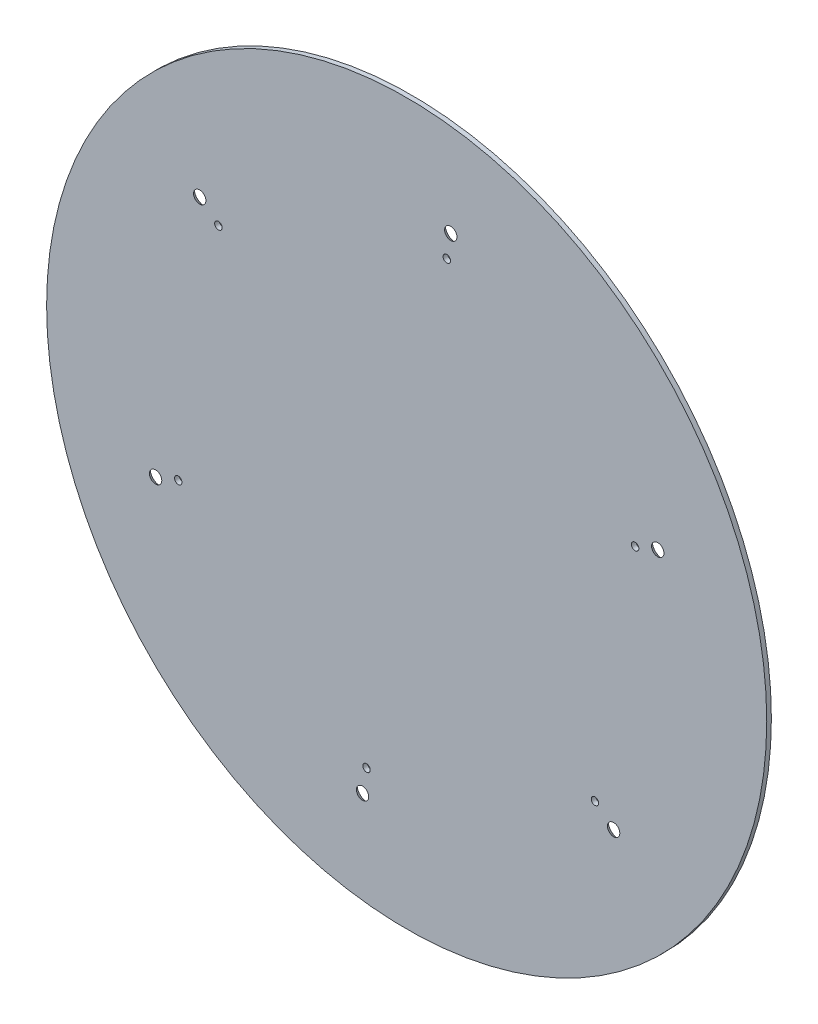
ISO-10303-21;
HEADER;
FILE_DESCRIPTION(('STEP AP214'),'2;1');
FILE_NAME('part.step','',(''),(''),'','','');
FILE_SCHEMA(('AUTOMOTIVE_DESIGN { 1 0 10303 214 1 1 1 1 }'));
ENDSEC;
DATA;
#1=APPLICATION_CONTEXT('core data for automotive mechanical design processes');
#2=APPLICATION_PROTOCOL_DEFINITION('international standard','automotive_design',2000,#1);
#3=PRODUCT_CONTEXT('',#1,'mechanical');
#4=PRODUCT('Part','Part','',(#3));
#5=PRODUCT_RELATED_PRODUCT_CATEGORY('part','',(#4));
#6=PRODUCT_DEFINITION_FORMATION('','',#4);
#7=PRODUCT_DEFINITION_CONTEXT('part definition',#1,'design');
#8=PRODUCT_DEFINITION('design','',#6,#7);
#9=PRODUCT_DEFINITION_SHAPE('','',#8);
#10=(LENGTH_UNIT() NAMED_UNIT(*) SI_UNIT(.MILLI.,.METRE.));
#11=(NAMED_UNIT(*) PLANE_ANGLE_UNIT() SI_UNIT($,.RADIAN.));
#12=(NAMED_UNIT(*) SI_UNIT($,.STERADIAN.) SOLID_ANGLE_UNIT());
#13=UNCERTAINTY_MEASURE_WITH_UNIT(LENGTH_MEASURE(1.E-05),#10,'distance_accuracy_value','');
#14=(GEOMETRIC_REPRESENTATION_CONTEXT(3) GLOBAL_UNCERTAINTY_ASSIGNED_CONTEXT((#13)) GLOBAL_UNIT_ASSIGNED_CONTEXT((#10,
#11,#12)) REPRESENTATION_CONTEXT('',''));
#15=CARTESIAN_POINT('',(0.,0.,0.));
#16=DIRECTION('',(0.,0.,1.));
#17=DIRECTION('',(1.,0.,0.));
#18=AXIS2_PLACEMENT_3D('',#15,#16,#17);
#19=CARTESIAN_POINT('',(0.,0.,2.));
#20=DIRECTION('',(0.,0.,-1.));
#21=DIRECTION('',(-1.,0.,0.));
#22=AXIS2_PLACEMENT_3D('',#19,#20,#21);
#23=CYLINDRICAL_SURFACE('',#22,155.);
#24=CARTESIAN_POINT('',(0.,0.,2.));
#25=DIRECTION('',(0.,0.,1.));
#26=DIRECTION('',(1.,0.,0.));
#27=AXIS2_PLACEMENT_3D('',#24,#25,#26);
#28=CIRCLE('',#27,155.);
#29=CARTESIAN_POINT('',(155.,0.,2.));
#30=VERTEX_POINT('',#29);
#31=EDGE_CURVE('E10',#30,#30,#28,.T.);
#32=ORIENTED_EDGE('',*,*,#31,.F.);
#33=EDGE_LOOP('',(#32));
#34=FACE_BOUND('',#33,.T.);
#35=CARTESIAN_POINT('',(0.,0.,0.));
#36=DIRECTION('',(0.,0.,1.));
#37=DIRECTION('',(1.,0.,0.));
#38=AXIS2_PLACEMENT_3D('',#35,#36,#37);
#39=CIRCLE('',#38,155.);
#40=CARTESIAN_POINT('',(155.,0.,0.));
#41=VERTEX_POINT('',#40);
#42=EDGE_CURVE('E38',#41,#41,#39,.T.);
#43=ORIENTED_EDGE('',*,*,#42,.T.);
#44=EDGE_LOOP('',(#43));
#45=FACE_BOUND('',#44,.T.);
#46=ADVANCED_FACE('F31',(#34,#45),#23,.T.);
#47=CARTESIAN_POINT('',(0.,0.,2.));
#48=DIRECTION('',(0.,0.,1.));
#49=DIRECTION('',(1.,0.,0.));
#50=AXIS2_PLACEMENT_3D('',#47,#48,#49);
#51=PLANE('',#50);
#52=CARTESIAN_POINT('',(18.9812185559355,113.838400560304,2.));
#53=DIRECTION('',(0.,0.,1.));
#54=DIRECTION('',(1.,0.,0.));
#55=AXIS2_PLACEMENT_3D('',#52,#53,#54);
#56=CIRCLE('',#55,2.65168952436754);
#57=CARTESIAN_POINT('',(21.632908080303,113.838400560304,2.));
#58=VERTEX_POINT('',#57);
#59=EDGE_CURVE('E190',#58,#58,#56,.T.);
#60=ORIENTED_EDGE('',*,*,#59,.F.);
#61=EDGE_LOOP('',(#60));
#62=FACE_BOUND('',#61,.T.);
#63=CARTESIAN_POINT('',(-89.0885134468788,73.3669194652695,2.));
#64=DIRECTION('',(0.,0.,1.));
#65=DIRECTION('',(1.,0.,0.));
#66=AXIS2_PLACEMENT_3D('',#63,#64,#65);
#67=CIRCLE('',#66,2.65168952436754);
#68=CARTESIAN_POINT('',(-86.4368239225113,73.3669194652695,2.));
#69=VERTEX_POINT('',#68);
#70=EDGE_CURVE('E184',#69,#69,#67,.T.);
#71=ORIENTED_EDGE('',*,*,#70,.F.);
#72=EDGE_LOOP('',(#71));
#73=FACE_BOUND('',#72,.T.);
#74=CARTESIAN_POINT('',(-108.077556089395,-40.4809828159488,2.));
#75=DIRECTION('',(0.,0.,1.));
#76=DIRECTION('',(1.,0.,0.));
#77=AXIS2_PLACEMENT_3D('',#74,#75,#76);
#78=CIRCLE('',#77,2.65168952436754);
#79=CARTESIAN_POINT('',(-105.425866565028,-40.4809828159488,2.));
#80=VERTEX_POINT('',#79);
#81=EDGE_CURVE('E178',#80,#80,#78,.T.);
#82=ORIENTED_EDGE('',*,*,#81,.F.);
#83=EDGE_LOOP('',(#82));
#84=FACE_BOUND('',#83,.T.);
#85=CARTESIAN_POINT('',(108.077556089392,40.4809828159187,2.));
#86=DIRECTION('',(0.,0.,1.));
#87=DIRECTION('',(1.,0.,0.));
#88=AXIS2_PLACEMENT_3D('',#85,#86,#87);
#89=CIRCLE('',#88,2.65168952436754);
#90=CARTESIAN_POINT('',(110.72924561376,40.4809828159187,2.));
#91=VERTEX_POINT('',#90);
#92=EDGE_CURVE('E172',#91,#91,#89,.T.);
#93=ORIENTED_EDGE('',*,*,#92,.F.);
#94=EDGE_LOOP('',(#93));
#95=FACE_BOUND('',#94,.T.);
#96=CARTESIAN_POINT('',(89.088513446876,-73.3669194652996,2.));
#97=DIRECTION('',(0.,0.,1.));
#98=DIRECTION('',(1.,0.,0.));
#99=AXIS2_PLACEMENT_3D('',#96,#97,#98);
#100=CIRCLE('',#99,2.65168952436754);
#101=CARTESIAN_POINT('',(91.7402029712435,-73.3669194652996,2.));
#102=VERTEX_POINT('',#101);
#103=EDGE_CURVE('E155',#102,#102,#100,.T.);
#104=ORIENTED_EDGE('',*,*,#103,.F.);
#105=EDGE_LOOP('',(#104));
#106=FACE_BOUND('',#105,.T.);
#107=CARTESIAN_POINT('',(-18.9812185559384,-113.838400560335,2.));
#108=DIRECTION('',(0.,0.,1.));
#109=DIRECTION('',(1.,0.,0.));
#110=AXIS2_PLACEMENT_3D('',#107,#108,#109);
#111=CIRCLE('',#110,2.65168952436754);
#112=CARTESIAN_POINT('',(-16.3295290315709,-113.838400560335,2.));
#113=VERTEX_POINT('',#112);
#114=EDGE_CURVE('E148',#113,#113,#111,.T.);
#115=ORIENTED_EDGE('',*,*,#114,.F.);
#116=EDGE_LOOP('',(#115));
#117=FACE_BOUND('',#116,.T.);
#118=CARTESIAN_POINT('',(17.2801553569451,103.568316732676,2.));
#119=DIRECTION('',(0.,0.,1.));
#120=DIRECTION('',(1.,0.,0.));
#121=AXIS2_PLACEMENT_3D('',#118,#119,#120);
#122=CIRCLE('',#121,1.60000000029743);
#123=CARTESIAN_POINT('',(18.8801553572426,103.568316732676,2.));
#124=VERTEX_POINT('',#123);
#125=EDGE_CURVE('E52',#124,#124,#122,.T.);
#126=ORIENTED_EDGE('',*,*,#125,.F.);
#127=EDGE_LOOP('',(#126));
#128=FACE_BOUND('',#127,.T.);
#129=CARTESIAN_POINT('',(-81.0527156392176,66.7492118867941,2.));
#130=DIRECTION('',(0.,0.,1.));
#131=DIRECTION('',(1.,0.,0.));
#132=AXIS2_PLACEMENT_3D('',#129,#130,#131);
#133=CIRCLE('',#132,1.60000000006055);
#134=CARTESIAN_POINT('',(-79.452715639157,66.7492118867941,2.));
#135=VERTEX_POINT('',#134);
#136=EDGE_CURVE('E136',#135,#135,#133,.T.);
#137=ORIENTED_EDGE('',*,*,#136,.F.);
#138=EDGE_LOOP('',(#137));
#139=FACE_BOUND('',#138,.T.);
#140=CARTESIAN_POINT('',(-98.3328709961627,-36.8191048458816,2.));
#141=DIRECTION('',(0.,0.,1.));
#142=DIRECTION('',(1.,0.,0.));
#143=AXIS2_PLACEMENT_3D('',#140,#141,#142);
#144=CIRCLE('',#143,1.60000000000001);
#145=CARTESIAN_POINT('',(-96.7328709961627,-36.8191048458816,2.));
#146=VERTEX_POINT('',#145);
#147=EDGE_CURVE('E123',#146,#146,#144,.T.);
#148=ORIENTED_EDGE('',*,*,#147,.F.);
#149=EDGE_LOOP('',(#148));
#150=FACE_BOUND('',#149,.T.);
#151=CARTESIAN_POINT('',(-17.2801553569452,-103.568316732676,2.));
#152=DIRECTION('',(0.,0.,1.));
#153=DIRECTION('',(1.,0.,0.));
#154=AXIS2_PLACEMENT_3D('',#151,#152,#153);
#155=CIRCLE('',#154,1.59999999999777);
#156=CARTESIAN_POINT('',(-15.6801553569474,-103.568316732676,2.));
#157=VERTEX_POINT('',#156);
#158=EDGE_CURVE('E137',#157,#157,#155,.T.);
#159=ORIENTED_EDGE('',*,*,#158,.F.);
#160=EDGE_LOOP('',(#159));
#161=FACE_BOUND('',#160,.T.);
#162=CARTESIAN_POINT('',(81.0527156392175,-66.7492118867941,2.));
#163=DIRECTION('',(0.,0.,1.));
#164=DIRECTION('',(1.,0.,0.));
#165=AXIS2_PLACEMENT_3D('',#162,#163,#164);
#166=CIRCLE('',#165,1.60000000000276);
#167=CARTESIAN_POINT('',(82.6527156392203,-66.7492118867941,2.));
#168=VERTEX_POINT('',#167);
#169=EDGE_CURVE('E142',#168,#168,#166,.T.);
#170=ORIENTED_EDGE('',*,*,#169,.F.);
#171=EDGE_LOOP('',(#170));
#172=FACE_BOUND('',#171,.T.);
#173=CARTESIAN_POINT('',(98.3328709961627,36.8191048458816,2.));
#174=DIRECTION('',(0.,0.,1.));
#175=DIRECTION('',(1.,0.,0.));
#176=AXIS2_PLACEMENT_3D('',#173,#174,#175);
#177=CIRCLE('',#176,1.60000000004383);
#178=CARTESIAN_POINT('',(99.9328709962065,36.8191048458816,2.));
#179=VERTEX_POINT('',#178);
#180=EDGE_CURVE('E45',#179,#179,#177,.T.);
#181=ORIENTED_EDGE('',*,*,#180,.F.);
#182=EDGE_LOOP('',(#181));
#183=FACE_BOUND('',#182,.T.);
#184=ORIENTED_EDGE('',*,*,#31,.T.);
#185=EDGE_LOOP('',(#184));
#186=FACE_BOUND('',#185,.T.);
#187=ADVANCED_FACE('F87',(#62,#73,#84,#95,#106,#117,#128,#139,#150,#161,#172,#183,#186),#51,.T.);
#188=CARTESIAN_POINT('',(0.,0.,0.));
#189=DIRECTION('',(0.,0.,1.));
#190=DIRECTION('',(1.,0.,0.));
#191=AXIS2_PLACEMENT_3D('',#188,#189,#190);
#192=PLANE('',#191);
#193=CARTESIAN_POINT('',(18.9812185559355,113.838400560304,0.));
#194=DIRECTION('',(0.,0.,-1.));
#195=DIRECTION('',(-1.,0.,0.));
#196=AXIS2_PLACEMENT_3D('',#193,#194,#195);
#197=CIRCLE('',#196,4.390263);
#198=CARTESIAN_POINT('',(14.5909555559355,113.838400560304,0.));
#199=VERTEX_POINT('',#198);
#200=EDGE_CURVE('E193',#199,#199,#197,.T.);
#201=ORIENTED_EDGE('',*,*,#200,.F.);
#202=EDGE_LOOP('',(#201));
#203=FACE_BOUND('',#202,.T.);
#204=CARTESIAN_POINT('',(-89.0885134468788,73.3669194652695,0.));
#205=DIRECTION('',(0.,0.,-1.));
#206=DIRECTION('',(-1.,0.,0.));
#207=AXIS2_PLACEMENT_3D('',#204,#205,#206);
#208=CIRCLE('',#207,4.39026300000001);
#209=CARTESIAN_POINT('',(-93.4787764468788,73.3669194652695,0.));
#210=VERTEX_POINT('',#209);
#211=EDGE_CURVE('E187',#210,#210,#208,.T.);
#212=ORIENTED_EDGE('',*,*,#211,.F.);
#213=EDGE_LOOP('',(#212));
#214=FACE_BOUND('',#213,.T.);
#215=CARTESIAN_POINT('',(-108.077556089395,-40.4809828159488,0.));
#216=DIRECTION('',(0.,0.,-1.));
#217=DIRECTION('',(-1.,0.,0.));
#218=AXIS2_PLACEMENT_3D('',#215,#216,#217);
#219=CIRCLE('',#218,4.39026300000001);
#220=CARTESIAN_POINT('',(-112.467819089395,-40.4809828159488,0.));
#221=VERTEX_POINT('',#220);
#222=EDGE_CURVE('E181',#221,#221,#219,.T.);
#223=ORIENTED_EDGE('',*,*,#222,.F.);
#224=EDGE_LOOP('',(#223));
#225=FACE_BOUND('',#224,.T.);
#226=CARTESIAN_POINT('',(108.077556089392,40.4809828159187,0.));
#227=DIRECTION('',(0.,0.,-1.));
#228=DIRECTION('',(-1.,0.,0.));
#229=AXIS2_PLACEMENT_3D('',#226,#227,#228);
#230=CIRCLE('',#229,4.39026300000001);
#231=CARTESIAN_POINT('',(103.687293089392,40.4809828159187,0.));
#232=VERTEX_POINT('',#231);
#233=EDGE_CURVE('E175',#232,#232,#230,.T.);
#234=ORIENTED_EDGE('',*,*,#233,.F.);
#235=EDGE_LOOP('',(#234));
#236=FACE_BOUND('',#235,.T.);
#237=CARTESIAN_POINT('',(89.088513446876,-73.3669194652996,0.));
#238=DIRECTION('',(0.,0.,-1.));
#239=DIRECTION('',(-1.,0.,0.));
#240=AXIS2_PLACEMENT_3D('',#237,#238,#239);
#241=CIRCLE('',#240,4.39026300000001);
#242=CARTESIAN_POINT('',(84.698250446876,-73.3669194652996,0.));
#243=VERTEX_POINT('',#242);
#244=EDGE_CURVE('E169',#243,#243,#241,.T.);
#245=ORIENTED_EDGE('',*,*,#244,.F.);
#246=EDGE_LOOP('',(#245));
#247=FACE_BOUND('',#246,.T.);
#248=CARTESIAN_POINT('',(-18.9812185559384,-113.838400560335,0.));
#249=DIRECTION('',(0.,0.,-1.));
#250=DIRECTION('',(-1.,0.,0.));
#251=AXIS2_PLACEMENT_3D('',#248,#249,#250);
#252=CIRCLE('',#251,4.390263);
#253=CARTESIAN_POINT('',(-23.3714815559384,-113.838400560335,0.));
#254=VERTEX_POINT('',#253);
#255=EDGE_CURVE('E151',#254,#254,#252,.T.);
#256=ORIENTED_EDGE('',*,*,#255,.F.);
#257=EDGE_LOOP('',(#256));
#258=FACE_BOUND('',#257,.T.);
#259=CARTESIAN_POINT('',(17.2801553569451,103.568316732676,0.));
#260=DIRECTION('',(0.,0.,1.));
#261=DIRECTION('',(1.,0.,0.));
#262=AXIS2_PLACEMENT_3D('',#259,#260,#261);
#263=CIRCLE('',#262,1.60000000029743);
#264=CARTESIAN_POINT('',(18.8801553572426,103.568316732676,0.));
#265=VERTEX_POINT('',#264);
#266=EDGE_CURVE('E34',#265,#265,#263,.T.);
#267=ORIENTED_EDGE('',*,*,#266,.T.);
#268=EDGE_LOOP('',(#267));
#269=FACE_BOUND('',#268,.T.);
#270=CARTESIAN_POINT('',(-81.0527156392176,66.7492118867941,0.));
#271=DIRECTION('',(0.,0.,1.));
#272=DIRECTION('',(1.,0.,0.));
#273=AXIS2_PLACEMENT_3D('',#270,#271,#272);
#274=CIRCLE('',#273,1.60000000006055);
#275=CARTESIAN_POINT('',(-79.452715639157,66.7492118867941,0.));
#276=VERTEX_POINT('',#275);
#277=EDGE_CURVE('E60',#276,#276,#274,.T.);
#278=ORIENTED_EDGE('',*,*,#277,.T.);
#279=EDGE_LOOP('',(#278));
#280=FACE_BOUND('',#279,.T.);
#281=CARTESIAN_POINT('',(-98.3328709961627,-36.8191048458816,0.));
#282=DIRECTION('',(0.,0.,1.));
#283=DIRECTION('',(1.,0.,0.));
#284=AXIS2_PLACEMENT_3D('',#281,#282,#283);
#285=CIRCLE('',#284,1.60000000000001);
#286=CARTESIAN_POINT('',(-96.7328709961627,-36.8191048458816,0.));
#287=VERTEX_POINT('',#286);
#288=EDGE_CURVE('E58',#287,#287,#285,.T.);
#289=ORIENTED_EDGE('',*,*,#288,.T.);
#290=EDGE_LOOP('',(#289));
#291=FACE_BOUND('',#290,.T.);
#292=CARTESIAN_POINT('',(-17.2801553569452,-103.568316732676,0.));
#293=DIRECTION('',(0.,0.,1.));
#294=DIRECTION('',(1.,0.,0.));
#295=AXIS2_PLACEMENT_3D('',#292,#293,#294);
#296=CIRCLE('',#295,1.59999999999777);
#297=CARTESIAN_POINT('',(-15.6801553569474,-103.568316732676,0.));
#298=VERTEX_POINT('',#297);
#299=EDGE_CURVE('E55',#298,#298,#296,.T.);
#300=ORIENTED_EDGE('',*,*,#299,.T.);
#301=EDGE_LOOP('',(#300));
#302=FACE_BOUND('',#301,.T.);
#303=CARTESIAN_POINT('',(81.0527156392175,-66.7492118867941,0.));
#304=DIRECTION('',(0.,0.,1.));
#305=DIRECTION('',(1.,0.,0.));
#306=AXIS2_PLACEMENT_3D('',#303,#304,#305);
#307=CIRCLE('',#306,1.60000000000276);
#308=CARTESIAN_POINT('',(82.6527156392203,-66.7492118867941,0.));
#309=VERTEX_POINT('',#308);
#310=EDGE_CURVE('E51',#309,#309,#307,.T.);
#311=ORIENTED_EDGE('',*,*,#310,.T.);
#312=EDGE_LOOP('',(#311));
#313=FACE_BOUND('',#312,.T.);
#314=CARTESIAN_POINT('',(98.3328709961627,36.8191048458816,0.));
#315=DIRECTION('',(0.,0.,1.));
#316=DIRECTION('',(1.,0.,0.));
#317=AXIS2_PLACEMENT_3D('',#314,#315,#316);
#318=CIRCLE('',#317,1.60000000004383);
#319=CARTESIAN_POINT('',(99.9328709962065,36.8191048458816,0.));
#320=VERTEX_POINT('',#319);
#321=EDGE_CURVE('E48',#320,#320,#318,.T.);
#322=ORIENTED_EDGE('',*,*,#321,.T.);
#323=EDGE_LOOP('',(#322));
#324=FACE_BOUND('',#323,.T.);
#325=ORIENTED_EDGE('',*,*,#42,.F.);
#326=EDGE_LOOP('',(#325));
#327=FACE_BOUND('',#326,.T.);
#328=ADVANCED_FACE('F67',(#203,#214,#225,#236,#247,#258,#269,#280,#291,#302,#313,#324,#327),
#192,.F.);
#329=CARTESIAN_POINT('',(98.3328709961627,36.8191048458816,-8.));
#330=DIRECTION('',(0.,0.,1.));
#331=DIRECTION('',(1.,0.,0.));
#332=AXIS2_PLACEMENT_3D('',#329,#330,#331);
#333=CYLINDRICAL_SURFACE('',#332,1.60000000004383);
#334=ORIENTED_EDGE('',*,*,#180,.T.);
#335=EDGE_LOOP('',(#334));
#336=FACE_BOUND('',#335,.T.);
#337=ORIENTED_EDGE('',*,*,#321,.F.);
#338=EDGE_LOOP('',(#337));
#339=FACE_BOUND('',#338,.T.);
#340=ADVANCED_FACE('F98',(#336,#339),#333,.F.);
#341=CARTESIAN_POINT('',(81.0527156392175,-66.7492118867941,-8.));
#342=DIRECTION('',(0.,0.,1.));
#343=DIRECTION('',(1.,0.,0.));
#344=AXIS2_PLACEMENT_3D('',#341,#342,#343);
#345=CYLINDRICAL_SURFACE('',#344,1.60000000000276);
#346=ORIENTED_EDGE('',*,*,#169,.T.);
#347=EDGE_LOOP('',(#346));
#348=FACE_BOUND('',#347,.T.);
#349=ORIENTED_EDGE('',*,*,#310,.F.);
#350=EDGE_LOOP('',(#349));
#351=FACE_BOUND('',#350,.T.);
#352=ADVANCED_FACE('F103',(#348,#351),#345,.F.);
#353=CARTESIAN_POINT('',(-17.2801553569452,-103.568316732676,-8.));
#354=DIRECTION('',(0.,0.,1.));
#355=DIRECTION('',(1.,0.,0.));
#356=AXIS2_PLACEMENT_3D('',#353,#354,#355);
#357=CYLINDRICAL_SURFACE('',#356,1.59999999999777);
#358=ORIENTED_EDGE('',*,*,#158,.T.);
#359=EDGE_LOOP('',(#358));
#360=FACE_BOUND('',#359,.T.);
#361=ORIENTED_EDGE('',*,*,#299,.F.);
#362=EDGE_LOOP('',(#361));
#363=FACE_BOUND('',#362,.T.);
#364=ADVANCED_FACE('F111',(#360,#363),#357,.F.);
#365=CARTESIAN_POINT('',(-98.3328709961627,-36.8191048458816,-8.));
#366=DIRECTION('',(0.,0.,1.));
#367=DIRECTION('',(1.,0.,0.));
#368=AXIS2_PLACEMENT_3D('',#365,#366,#367);
#369=CYLINDRICAL_SURFACE('',#368,1.60000000000001);
#370=ORIENTED_EDGE('',*,*,#147,.T.);
#371=EDGE_LOOP('',(#370));
#372=FACE_BOUND('',#371,.T.);
#373=ORIENTED_EDGE('',*,*,#288,.F.);
#374=EDGE_LOOP('',(#373));
#375=FACE_BOUND('',#374,.T.);
#376=ADVANCED_FACE('F82',(#372,#375),#369,.F.);
#377=CARTESIAN_POINT('',(-81.0527156392176,66.7492118867941,-8.));
#378=DIRECTION('',(0.,0.,1.));
#379=DIRECTION('',(1.,0.,0.));
#380=AXIS2_PLACEMENT_3D('',#377,#378,#379);
#381=CYLINDRICAL_SURFACE('',#380,1.60000000006055);
#382=ORIENTED_EDGE('',*,*,#136,.T.);
#383=EDGE_LOOP('',(#382));
#384=FACE_BOUND('',#383,.T.);
#385=ORIENTED_EDGE('',*,*,#277,.F.);
#386=EDGE_LOOP('',(#385));
#387=FACE_BOUND('',#386,.T.);
#388=ADVANCED_FACE('F72',(#384,#387),#381,.F.);
#389=CARTESIAN_POINT('',(17.2801553569451,103.568316732676,-8.));
#390=DIRECTION('',(0.,0.,1.));
#391=DIRECTION('',(1.,0.,0.));
#392=AXIS2_PLACEMENT_3D('',#389,#390,#391);
#393=CYLINDRICAL_SURFACE('',#392,1.60000000029743);
#394=ORIENTED_EDGE('',*,*,#125,.T.);
#395=EDGE_LOOP('',(#394));
#396=FACE_BOUND('',#395,.T.);
#397=ORIENTED_EDGE('',*,*,#266,.F.);
#398=EDGE_LOOP('',(#397));
#399=FACE_BOUND('',#398,.T.);
#400=ADVANCED_FACE('F69',(#396,#399),#393,.F.);
#401=CARTESIAN_POINT('',(-18.9812185559384,-113.838400560335,0.));
#402=DIRECTION('',(0.,0.,-1.));
#403=DIRECTION('',(-1.,0.,0.));
#404=AXIS2_PLACEMENT_3D('',#401,#402,#403);
#405=CONICAL_SURFACE('',#404,4.390263,0.715584993317676);
#406=ORIENTED_EDGE('',*,*,#114,.T.);
#407=EDGE_LOOP('',(#406));
#408=FACE_BOUND('',#407,.T.);
#409=ORIENTED_EDGE('',*,*,#255,.T.);
#410=EDGE_LOOP('',(#409));
#411=FACE_BOUND('',#410,.T.);
#412=ADVANCED_FACE('F71',(#408,#411),#405,.F.);
#413=CARTESIAN_POINT('',(89.088513446876,-73.3669194652996,0.));
#414=DIRECTION('',(0.,0.,-1.));
#415=DIRECTION('',(-1.,0.,0.));
#416=AXIS2_PLACEMENT_3D('',#413,#414,#415);
#417=CONICAL_SURFACE('',#416,4.39026300000001,0.715584993317677);
#418=ORIENTED_EDGE('',*,*,#103,.T.);
#419=EDGE_LOOP('',(#418));
#420=FACE_BOUND('',#419,.T.);
#421=ORIENTED_EDGE('',*,*,#244,.T.);
#422=EDGE_LOOP('',(#421));
#423=FACE_BOUND('',#422,.T.);
#424=ADVANCED_FACE('F79',(#420,#423),#417,.F.);
#425=CARTESIAN_POINT('',(108.077556089392,40.4809828159187,0.));
#426=DIRECTION('',(0.,0.,-1.));
#427=DIRECTION('',(-1.,0.,0.));
#428=AXIS2_PLACEMENT_3D('',#425,#426,#427);
#429=CONICAL_SURFACE('',#428,4.39026300000001,0.715584993317677);
#430=ORIENTED_EDGE('',*,*,#92,.T.);
#431=EDGE_LOOP('',(#430));
#432=FACE_BOUND('',#431,.T.);
#433=ORIENTED_EDGE('',*,*,#233,.T.);
#434=EDGE_LOOP('',(#433));
#435=FACE_BOUND('',#434,.T.);
#436=ADVANCED_FACE('F210',(#432,#435),#429,.F.);
#437=CARTESIAN_POINT('',(-108.077556089395,-40.4809828159488,0.));
#438=DIRECTION('',(0.,0.,-1.));
#439=DIRECTION('',(-1.,0.,0.));
#440=AXIS2_PLACEMENT_3D('',#437,#438,#439);
#441=CONICAL_SURFACE('',#440,4.39026300000001,0.715584993317677);
#442=ORIENTED_EDGE('',*,*,#81,.T.);
#443=EDGE_LOOP('',(#442));
#444=FACE_BOUND('',#443,.T.);
#445=ORIENTED_EDGE('',*,*,#222,.T.);
#446=EDGE_LOOP('',(#445));
#447=FACE_BOUND('',#446,.T.);
#448=ADVANCED_FACE('F204',(#444,#447),#441,.F.);
#449=CARTESIAN_POINT('',(-89.0885134468788,73.3669194652695,0.));
#450=DIRECTION('',(0.,0.,-1.));
#451=DIRECTION('',(-1.,0.,0.));
#452=AXIS2_PLACEMENT_3D('',#449,#450,#451);
#453=CONICAL_SURFACE('',#452,4.39026300000001,0.715584993317677);
#454=ORIENTED_EDGE('',*,*,#70,.T.);
#455=EDGE_LOOP('',(#454));
#456=FACE_BOUND('',#455,.T.);
#457=ORIENTED_EDGE('',*,*,#211,.T.);
#458=EDGE_LOOP('',(#457));
#459=FACE_BOUND('',#458,.T.);
#460=ADVANCED_FACE('F198',(#456,#459),#453,.F.);
#461=CARTESIAN_POINT('',(18.9812185559355,113.838400560304,0.));
#462=DIRECTION('',(0.,0.,-1.));
#463=DIRECTION('',(-1.,0.,0.));
#464=AXIS2_PLACEMENT_3D('',#461,#462,#463);
#465=CONICAL_SURFACE('',#464,4.390263,0.715584993317676);
#466=ORIENTED_EDGE('',*,*,#59,.T.);
#467=EDGE_LOOP('',(#466));
#468=FACE_BOUND('',#467,.T.);
#469=ORIENTED_EDGE('',*,*,#200,.T.);
#470=EDGE_LOOP('',(#469));
#471=FACE_BOUND('',#470,.T.);
#472=ADVANCED_FACE('F196',(#468,#471),#465,.F.);
#473=CLOSED_SHELL('',(#46,#187,#328,#340,#352,#364,#376,#388,#400,#412,#424,#436,#448,#460,#472));
#474=MANIFOLD_SOLID_BREP('B2',#473);
#475=ADVANCED_BREP_SHAPE_REPRESENTATION('',(#18,#474),#14);
#476=SHAPE_DEFINITION_REPRESENTATION(#9,#475);
ENDSEC;
END-ISO-10303-21;
